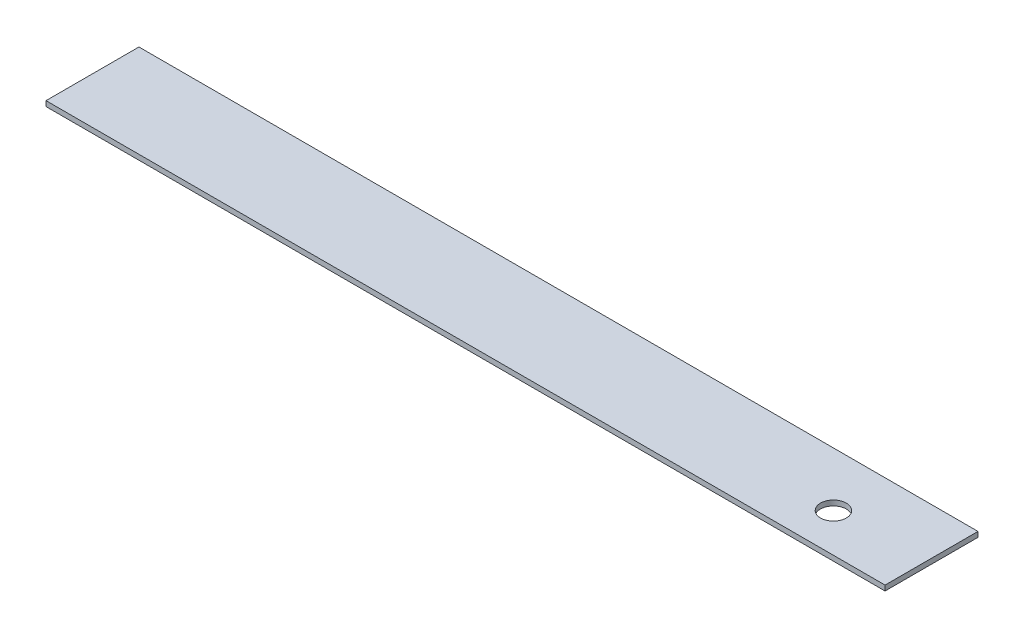
ISO-10303-21;
HEADER;
FILE_DESCRIPTION(('STEP AP214'),'2;1');
FILE_NAME('part.step','',(''),(''),'','','');
FILE_SCHEMA(('AUTOMOTIVE_DESIGN { 1 0 10303 214 1 1 1 1 }'));
ENDSEC;
DATA;
#1=APPLICATION_CONTEXT('core data for automotive mechanical design processes');
#2=APPLICATION_PROTOCOL_DEFINITION('international standard','automotive_design',2000,#1);
#3=PRODUCT_CONTEXT('',#1,'mechanical');
#4=PRODUCT('Part','Part','',(#3));
#5=PRODUCT_RELATED_PRODUCT_CATEGORY('part','',(#4));
#6=PRODUCT_DEFINITION_FORMATION('','',#4);
#7=PRODUCT_DEFINITION_CONTEXT('part definition',#1,'design');
#8=PRODUCT_DEFINITION('design','',#6,#7);
#9=PRODUCT_DEFINITION_SHAPE('','',#8);
#10=(LENGTH_UNIT() NAMED_UNIT(*) SI_UNIT(.MILLI.,.METRE.));
#11=(NAMED_UNIT(*) PLANE_ANGLE_UNIT() SI_UNIT($,.RADIAN.));
#12=(NAMED_UNIT(*) SI_UNIT($,.STERADIAN.) SOLID_ANGLE_UNIT());
#13=UNCERTAINTY_MEASURE_WITH_UNIT(LENGTH_MEASURE(1.E-05),#10,'distance_accuracy_value','');
#14=(GEOMETRIC_REPRESENTATION_CONTEXT(3) GLOBAL_UNCERTAINTY_ASSIGNED_CONTEXT((#13)) GLOBAL_UNIT_ASSIGNED_CONTEXT((#10,
#11,#12)) REPRESENTATION_CONTEXT('',''));
#15=CARTESIAN_POINT('',(0.,0.,0.));
#16=DIRECTION('',(0.,0.,1.));
#17=DIRECTION('',(1.,0.,0.));
#18=AXIS2_PLACEMENT_3D('',#15,#16,#17);
#19=CARTESIAN_POINT('',(162.5,-2.,18.));
#20=DIRECTION('',(0.,1.,0.));
#21=DIRECTION('',(0.,0.,1.));
#22=AXIS2_PLACEMENT_3D('',#19,#20,#21);
#23=PLANE('',#22);
#24=CARTESIAN_POINT('',(127.5,-2.,3.));
#25=DIRECTION('',(0.,-1.,0.));
#26=DIRECTION('',(0.,0.,-1.));
#27=AXIS2_PLACEMENT_3D('',#24,#25,#26);
#28=CIRCLE('',#27,4.99999999999999);
#29=CARTESIAN_POINT('',(127.5,-2.,-1.99999999999999));
#30=VERTEX_POINT('',#29);
#31=EDGE_CURVE('E110',#30,#30,#28,.T.);
#32=ORIENTED_EDGE('',*,*,#31,.F.);
#33=EDGE_LOOP('',(#32));
#34=FACE_BOUND('',#33,.T.);
#35=DIRECTION('',(0.,0.,-1.));
#36=VECTOR('',#35,1.);
#37=CARTESIAN_POINT('',(-162.5,-2.,18.));
#38=LINE('',#37,#36);
#39=CARTESIAN_POINT('',(-162.5,-2.,18.));
#40=VERTEX_POINT('',#39);
#41=CARTESIAN_POINT('',(-162.5,-2.,-18.));
#42=VERTEX_POINT('',#41);
#43=EDGE_CURVE('E98',#40,#42,#38,.T.);
#44=ORIENTED_EDGE('',*,*,#43,.T.);
#45=DIRECTION('',(-1.,0.,0.));
#46=VECTOR('',#45,1.);
#47=CARTESIAN_POINT('',(162.5,-2.,-18.));
#48=LINE('',#47,#46);
#49=CARTESIAN_POINT('',(162.5,-2.,-18.));
#50=VERTEX_POINT('',#49);
#51=EDGE_CURVE('E11',#50,#42,#48,.T.);
#52=ORIENTED_EDGE('',*,*,#51,.F.);
#53=DIRECTION('',(0.,0.,-1.));
#54=VECTOR('',#53,1.);
#55=CARTESIAN_POINT('',(162.5,-2.,18.));
#56=LINE('',#55,#54);
#57=CARTESIAN_POINT('',(162.5,-2.,18.));
#58=VERTEX_POINT('',#57);
#59=EDGE_CURVE('E75',#58,#50,#56,.T.);
#60=ORIENTED_EDGE('',*,*,#59,.F.);
#61=DIRECTION('',(-1.,0.,0.));
#62=VECTOR('',#61,1.);
#63=CARTESIAN_POINT('',(162.5,-2.,18.));
#64=LINE('',#63,#62);
#65=EDGE_CURVE('E51',#58,#40,#64,.T.);
#66=ORIENTED_EDGE('',*,*,#65,.T.);
#67=EDGE_LOOP('',(#44,#52,#60,#66));
#68=FACE_BOUND('',#67,.T.);
#69=ADVANCED_FACE('F35',(#34,#68),#23,.F.);
#70=CARTESIAN_POINT('',(162.5,0.,-18.));
#71=DIRECTION('',(0.,0.,-1.));
#72=DIRECTION('',(-1.,0.,0.));
#73=AXIS2_PLACEMENT_3D('',#70,#71,#72);
#74=PLANE('',#73);
#75=DIRECTION('',(0.,-1.,0.));
#76=VECTOR('',#75,1.);
#77=CARTESIAN_POINT('',(-162.5,0.,-18.));
#78=LINE('',#77,#76);
#79=CARTESIAN_POINT('',(-162.5,0.,-18.));
#80=VERTEX_POINT('',#79);
#81=EDGE_CURVE('E84',#80,#42,#78,.T.);
#82=ORIENTED_EDGE('',*,*,#81,.F.);
#83=DIRECTION('',(-1.,0.,0.));
#84=VECTOR('',#83,1.);
#85=CARTESIAN_POINT('',(162.5,0.,-18.));
#86=LINE('',#85,#84);
#87=CARTESIAN_POINT('',(162.5,0.,-18.));
#88=VERTEX_POINT('',#87);
#89=EDGE_CURVE('E43',#88,#80,#86,.T.);
#90=ORIENTED_EDGE('',*,*,#89,.F.);
#91=DIRECTION('',(0.,-1.,0.));
#92=VECTOR('',#91,1.);
#93=CARTESIAN_POINT('',(162.5,0.,-18.));
#94=LINE('',#93,#92);
#95=EDGE_CURVE('E82',#88,#50,#94,.T.);
#96=ORIENTED_EDGE('',*,*,#95,.T.);
#97=ORIENTED_EDGE('',*,*,#51,.T.);
#98=EDGE_LOOP('',(#82,#90,#96,#97));
#99=FACE_BOUND('',#98,.T.);
#100=ADVANCED_FACE('F81',(#99),#74,.T.);
#101=CARTESIAN_POINT('',(162.5,0.,18.));
#102=DIRECTION('',(0.,1.,0.));
#103=DIRECTION('',(0.,0.,1.));
#104=AXIS2_PLACEMENT_3D('',#101,#102,#103);
#105=PLANE('',#104);
#106=CARTESIAN_POINT('',(127.5,0.,3.));
#107=DIRECTION('',(0.,-1.,0.));
#108=DIRECTION('',(0.,0.,-1.));
#109=AXIS2_PLACEMENT_3D('',#106,#107,#108);
#110=CIRCLE('',#109,4.99999999999999);
#111=CARTESIAN_POINT('',(127.5,0.,-1.99999999999999));
#112=VERTEX_POINT('',#111);
#113=EDGE_CURVE('E100',#112,#112,#110,.T.);
#114=ORIENTED_EDGE('',*,*,#113,.T.);
#115=EDGE_LOOP('',(#114));
#116=FACE_BOUND('',#115,.T.);
#117=DIRECTION('',(0.,0.,-1.));
#118=VECTOR('',#117,1.);
#119=CARTESIAN_POINT('',(-162.5,0.,18.));
#120=LINE('',#119,#118);
#121=CARTESIAN_POINT('',(-162.5,0.,18.));
#122=VERTEX_POINT('',#121);
#123=EDGE_CURVE('E102',#122,#80,#120,.T.);
#124=ORIENTED_EDGE('',*,*,#123,.F.);
#125=DIRECTION('',(-1.,0.,0.));
#126=VECTOR('',#125,1.);
#127=CARTESIAN_POINT('',(162.5,0.,18.));
#128=LINE('',#127,#126);
#129=CARTESIAN_POINT('',(162.5,0.,18.));
#130=VERTEX_POINT('',#129);
#131=EDGE_CURVE('E64',#130,#122,#128,.T.);
#132=ORIENTED_EDGE('',*,*,#131,.F.);
#133=DIRECTION('',(0.,0.,-1.));
#134=VECTOR('',#133,1.);
#135=CARTESIAN_POINT('',(162.5,0.,18.));
#136=LINE('',#135,#134);
#137=EDGE_CURVE('E90',#130,#88,#136,.T.);
#138=ORIENTED_EDGE('',*,*,#137,.T.);
#139=ORIENTED_EDGE('',*,*,#89,.T.);
#140=EDGE_LOOP('',(#124,#132,#138,#139));
#141=FACE_BOUND('',#140,.T.);
#142=ADVANCED_FACE('F92',(#116,#141),#105,.T.);
#143=CARTESIAN_POINT('',(162.5,-2.,18.));
#144=DIRECTION('',(0.,0.,1.));
#145=DIRECTION('',(1.,0.,0.));
#146=AXIS2_PLACEMENT_3D('',#143,#144,#145);
#147=PLANE('',#146);
#148=DIRECTION('',(0.,1.,0.));
#149=VECTOR('',#148,1.);
#150=CARTESIAN_POINT('',(-162.5,-2.,18.));
#151=LINE('',#150,#149);
#152=EDGE_CURVE('E104',#40,#122,#151,.T.);
#153=ORIENTED_EDGE('',*,*,#152,.F.);
#154=ORIENTED_EDGE('',*,*,#65,.F.);
#155=DIRECTION('',(0.,1.,0.));
#156=VECTOR('',#155,1.);
#157=CARTESIAN_POINT('',(162.5,-2.,18.));
#158=LINE('',#157,#156);
#159=EDGE_CURVE('E93',#58,#130,#158,.T.);
#160=ORIENTED_EDGE('',*,*,#159,.T.);
#161=ORIENTED_EDGE('',*,*,#131,.T.);
#162=EDGE_LOOP('',(#153,#154,#160,#161));
#163=FACE_BOUND('',#162,.T.);
#164=ADVANCED_FACE('F130',(#163),#147,.T.);
#165=CARTESIAN_POINT('',(162.5,-2.,-18.));
#166=DIRECTION('',(-1.,0.,0.));
#167=DIRECTION('',(0.,0.,1.));
#168=AXIS2_PLACEMENT_3D('',#165,#166,#167);
#169=PLANE('',#168);
#170=ORIENTED_EDGE('',*,*,#59,.T.);
#171=ORIENTED_EDGE('',*,*,#95,.F.);
#172=ORIENTED_EDGE('',*,*,#137,.F.);
#173=ORIENTED_EDGE('',*,*,#159,.F.);
#174=EDGE_LOOP('',(#170,#171,#172,#173));
#175=FACE_BOUND('',#174,.T.);
#176=ADVANCED_FACE('F89',(#175),#169,.F.);
#177=CARTESIAN_POINT('',(-162.5,-2.,-18.));
#178=DIRECTION('',(-1.,0.,0.));
#179=DIRECTION('',(0.,0.,1.));
#180=AXIS2_PLACEMENT_3D('',#177,#178,#179);
#181=PLANE('',#180);
#182=ORIENTED_EDGE('',*,*,#43,.F.);
#183=ORIENTED_EDGE('',*,*,#152,.T.);
#184=ORIENTED_EDGE('',*,*,#123,.T.);
#185=ORIENTED_EDGE('',*,*,#81,.T.);
#186=EDGE_LOOP('',(#182,#183,#184,#185));
#187=FACE_BOUND('',#186,.T.);
#188=ADVANCED_FACE('F120',(#187),#181,.T.);
#189=CARTESIAN_POINT('',(127.5,0.,3.));
#190=DIRECTION('',(0.,-1.,0.));
#191=DIRECTION('',(0.,0.,-1.));
#192=AXIS2_PLACEMENT_3D('',#189,#190,#191);
#193=CYLINDRICAL_SURFACE('',#192,4.99999999999999);
#194=ORIENTED_EDGE('',*,*,#113,.F.);
#195=EDGE_LOOP('',(#194));
#196=FACE_BOUND('',#195,.T.);
#197=ORIENTED_EDGE('',*,*,#31,.T.);
#198=EDGE_LOOP('',(#197));
#199=FACE_BOUND('',#198,.T.);
#200=ADVANCED_FACE('F117',(#196,#199),#193,.F.);
#201=CLOSED_SHELL('',(#69,#100,#142,#164,#176,#188,#200));
#202=MANIFOLD_SOLID_BREP('B2',#201);
#203=ADVANCED_BREP_SHAPE_REPRESENTATION('',(#18,#202),#14);
#204=SHAPE_DEFINITION_REPRESENTATION(#9,#203);
ENDSEC;
END-ISO-10303-21;
